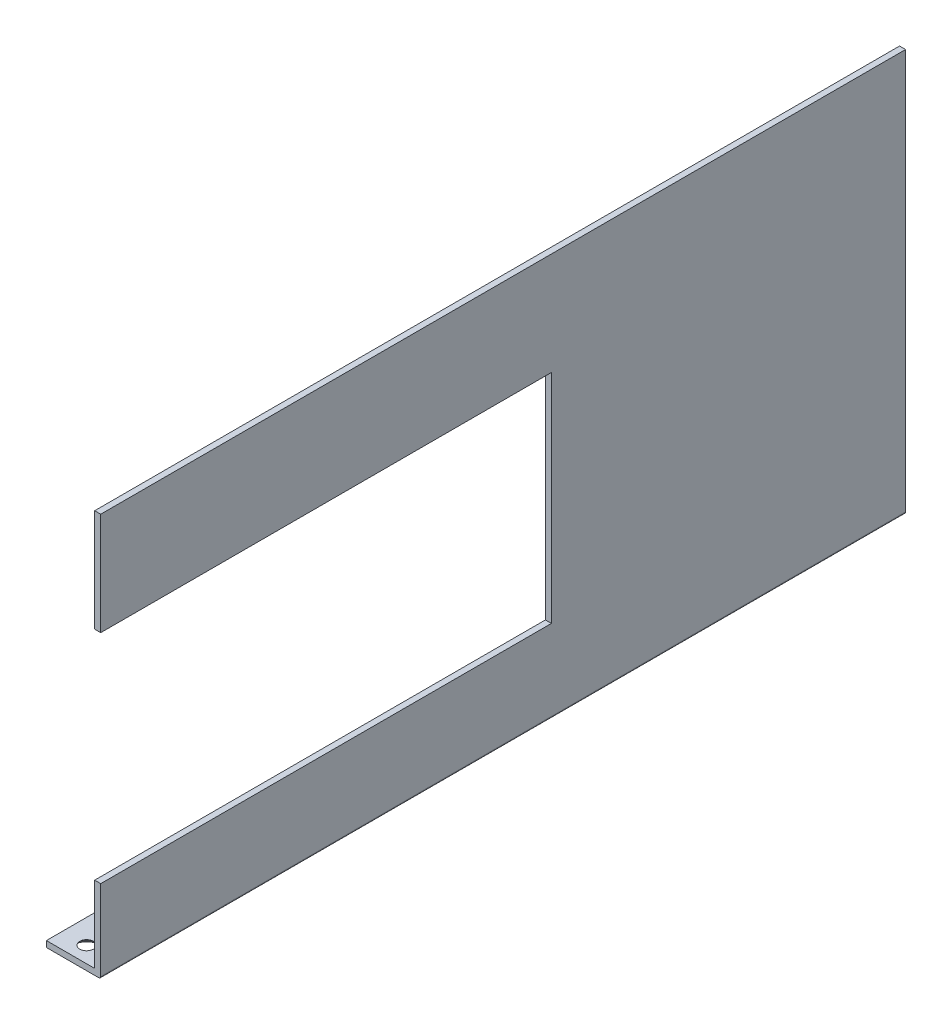
ISO-10303-21;
HEADER;
FILE_DESCRIPTION(('STEP AP214'),'2;1');
FILE_NAME('part.step','',(''),(''),'','','');
FILE_SCHEMA(('AUTOMOTIVE_DESIGN { 1 0 10303 214 1 1 1 1 }'));
ENDSEC;
DATA;
#1=APPLICATION_CONTEXT('core data for automotive mechanical design processes');
#2=APPLICATION_PROTOCOL_DEFINITION('international standard','automotive_design',2000,#1);
#3=PRODUCT_CONTEXT('',#1,'mechanical');
#4=PRODUCT('Part','Part','',(#3));
#5=PRODUCT_RELATED_PRODUCT_CATEGORY('part','',(#4));
#6=PRODUCT_DEFINITION_FORMATION('','',#4);
#7=PRODUCT_DEFINITION_CONTEXT('part definition',#1,'design');
#8=PRODUCT_DEFINITION('design','',#6,#7);
#9=PRODUCT_DEFINITION_SHAPE('','',#8);
#10=(LENGTH_UNIT() NAMED_UNIT(*) SI_UNIT(.MILLI.,.METRE.));
#11=(NAMED_UNIT(*) PLANE_ANGLE_UNIT() SI_UNIT($,.RADIAN.));
#12=(NAMED_UNIT(*) SI_UNIT($,.STERADIAN.) SOLID_ANGLE_UNIT());
#13=UNCERTAINTY_MEASURE_WITH_UNIT(LENGTH_MEASURE(1.E-05),#10,'distance_accuracy_value','');
#14=(GEOMETRIC_REPRESENTATION_CONTEXT(3) GLOBAL_UNCERTAINTY_ASSIGNED_CONTEXT((#13)) GLOBAL_UNIT_ASSIGNED_CONTEXT((#10,
#11,#12)) REPRESENTATION_CONTEXT('',''));
#15=CARTESIAN_POINT('',(0.,0.,0.));
#16=DIRECTION('',(0.,0.,1.));
#17=DIRECTION('',(1.,0.,0.));
#18=AXIS2_PLACEMENT_3D('',#15,#16,#17);
#19=CARTESIAN_POINT('',(12.,1.5,200.));
#20=DIRECTION('',(0.,-1.,0.));
#21=DIRECTION('',(1.,0.,0.));
#22=AXIS2_PLACEMENT_3D('',#19,#20,#21);
#23=PLANE('',#22);
#24=CARTESIAN_POINT('',(6.,1.5,196.));
#25=DIRECTION('',(0.,-1.,0.));
#26=DIRECTION('',(1.,0.,0.));
#27=AXIS2_PLACEMENT_3D('',#24,#25,#26);
#28=CIRCLE('',#27,1.69999999999999);
#29=CARTESIAN_POINT('',(7.69999999999999,1.5,196.));
#30=VERTEX_POINT('',#29);
#31=EDGE_CURVE('E226',#30,#30,#28,.F.);
#32=ORIENTED_EDGE('',*,*,#31,.F.);
#33=EDGE_LOOP('',(#32));
#34=FACE_BOUND('',#33,.T.);
#35=DIRECTION('',(-1.,0.,0.));
#36=VECTOR('',#35,1.);
#37=CARTESIAN_POINT('',(12.,1.5,0.));
#38=LINE('',#37,#36);
#39=CARTESIAN_POINT('',(12.,1.5,0.));
#40=VERTEX_POINT('',#39);
#41=CARTESIAN_POINT('',(0.,1.5,0.));
#42=VERTEX_POINT('',#41);
#43=EDGE_CURVE('E192',#40,#42,#38,.T.);
#44=ORIENTED_EDGE('',*,*,#43,.T.);
#45=DIRECTION('',(0.,0.,-1.));
#46=VECTOR('',#45,1.);
#47=CARTESIAN_POINT('',(0.,1.5,200.));
#48=LINE('',#47,#46);
#49=CARTESIAN_POINT('',(0.,1.5,200.));
#50=VERTEX_POINT('',#49);
#51=EDGE_CURVE('E149',#50,#42,#48,.T.);
#52=ORIENTED_EDGE('',*,*,#51,.F.);
#53=DIRECTION('',(-1.,0.,0.));
#54=VECTOR('',#53,1.);
#55=CARTESIAN_POINT('',(12.,1.5,200.));
#56=LINE('',#55,#54);
#57=CARTESIAN_POINT('',(12.,1.5,200.));
#58=VERTEX_POINT('',#57);
#59=EDGE_CURVE('E147',#58,#50,#56,.T.);
#60=ORIENTED_EDGE('',*,*,#59,.F.);
#61=DIRECTION('',(0.,0.,-1.));
#62=VECTOR('',#61,1.);
#63=CARTESIAN_POINT('',(12.,1.5,200.));
#64=LINE('',#63,#62);
#65=EDGE_CURVE('E152',#58,#40,#64,.T.);
#66=ORIENTED_EDGE('',*,*,#65,.T.);
#67=EDGE_LOOP('',(#44,#52,#60,#66));
#68=FACE_BOUND('',#67,.T.);
#69=CARTESIAN_POINT('',(6.,1.5,4.));
#70=DIRECTION('',(0.,-1.,0.));
#71=DIRECTION('',(1.,0.,0.));
#72=AXIS2_PLACEMENT_3D('',#69,#70,#71);
#73=CIRCLE('',#72,1.69999999999999);
#74=CARTESIAN_POINT('',(7.69999999999999,1.5,4.));
#75=VERTEX_POINT('',#74);
#76=EDGE_CURVE('E119',#75,#75,#73,.F.);
#77=ORIENTED_EDGE('',*,*,#76,.F.);
#78=EDGE_LOOP('',(#77));
#79=FACE_BOUND('',#78,.T.);
#80=ADVANCED_FACE('F31',(#34,#68,#79),#23,.F.);
#81=CARTESIAN_POINT('',(0.,100.,200.));
#82=DIRECTION('',(0.,0.,-1.));
#83=DIRECTION('',(-1.,0.,0.));
#84=AXIS2_PLACEMENT_3D('',#81,#82,#83);
#85=PLANE('',#84);
#86=DIRECTION('',(0.,-1.,0.));
#87=VECTOR('',#86,1.);
#88=CARTESIAN_POINT('',(12.,100.,200.));
#89=LINE('',#88,#87);
#90=CARTESIAN_POINT('',(12.,100.,200.));
#91=VERTEX_POINT('',#90);
#92=CARTESIAN_POINT('',(12.,74.5,200.));
#93=VERTEX_POINT('',#92);
#94=EDGE_CURVE('E144',#91,#93,#89,.T.);
#95=ORIENTED_EDGE('',*,*,#94,.T.);
#96=DIRECTION('',(-1.,0.,0.));
#97=VECTOR('',#96,1.);
#98=CARTESIAN_POINT('',(0.,74.5,200.));
#99=LINE('',#98,#97);
#100=CARTESIAN_POINT('',(13.5,74.5,200.));
#101=VERTEX_POINT('',#100);
#102=EDGE_CURVE('E118',#101,#93,#99,.T.);
#103=ORIENTED_EDGE('',*,*,#102,.F.);
#104=DIRECTION('',(0.,1.,0.));
#105=VECTOR('',#104,1.);
#106=CARTESIAN_POINT('',(13.5,0.,200.));
#107=LINE('',#106,#105);
#108=CARTESIAN_POINT('',(13.5,100.,200.));
#109=VERTEX_POINT('',#108);
#110=EDGE_CURVE('E136',#101,#109,#107,.T.);
#111=ORIENTED_EDGE('',*,*,#110,.T.);
#112=DIRECTION('',(-1.,0.,0.));
#113=VECTOR('',#112,1.);
#114=CARTESIAN_POINT('',(13.5,100.,200.));
#115=LINE('',#114,#113);
#116=EDGE_CURVE('E135',#109,#91,#115,.T.);
#117=ORIENTED_EDGE('',*,*,#116,.T.);
#118=EDGE_LOOP('',(#95,#103,#111,#117));
#119=FACE_BOUND('',#118,.T.);
#120=ADVANCED_FACE('F259',(#119),#85,.F.);
#121=CARTESIAN_POINT('',(0.,1.5,200.));
#122=DIRECTION('',(1.,0.,0.));
#123=DIRECTION('',(0.,1.,0.));
#124=AXIS2_PLACEMENT_3D('',#121,#122,#123);
#125=PLANE('',#124);
#126=DIRECTION('',(0.,-1.,0.));
#127=VECTOR('',#126,1.);
#128=CARTESIAN_POINT('',(0.,1.5,0.));
#129=LINE('',#128,#127);
#130=CARTESIAN_POINT('',(0.,0.,0.));
#131=VERTEX_POINT('',#130);
#132=EDGE_CURVE('E178',#42,#131,#129,.T.);
#133=ORIENTED_EDGE('',*,*,#132,.T.);
#134=DIRECTION('',(0.,0.,-1.));
#135=VECTOR('',#134,1.);
#136=CARTESIAN_POINT('',(0.,0.,200.));
#137=LINE('',#136,#135);
#138=CARTESIAN_POINT('',(0.,0.,200.));
#139=VERTEX_POINT('',#138);
#140=EDGE_CURVE('E161',#139,#131,#137,.T.);
#141=ORIENTED_EDGE('',*,*,#140,.F.);
#142=DIRECTION('',(0.,-1.,0.));
#143=VECTOR('',#142,1.);
#144=CARTESIAN_POINT('',(0.,1.5,200.));
#145=LINE('',#144,#143);
#146=EDGE_CURVE('E195',#50,#139,#145,.T.);
#147=ORIENTED_EDGE('',*,*,#146,.F.);
#148=ORIENTED_EDGE('',*,*,#51,.T.);
#149=EDGE_LOOP('',(#133,#141,#147,#148));
#150=FACE_BOUND('',#149,.T.);
#151=ADVANCED_FACE('F33',(#150),#125,.F.);
#152=CARTESIAN_POINT('',(0.,0.,200.));
#153=DIRECTION('',(0.,1.,0.));
#154=DIRECTION('',(0.,0.,1.));
#155=AXIS2_PLACEMENT_3D('',#152,#153,#154);
#156=PLANE('',#155);
#157=CARTESIAN_POINT('',(6.,0.,196.));
#158=DIRECTION('',(0.,-1.,0.));
#159=DIRECTION('',(0.,0.,-1.));
#160=AXIS2_PLACEMENT_3D('',#157,#158,#159);
#161=CIRCLE('',#160,3.15);
#162=CARTESIAN_POINT('',(6.,0.,192.85));
#163=VERTEX_POINT('',#162);
#164=EDGE_CURVE('E232',#163,#163,#161,.T.);
#165=ORIENTED_EDGE('',*,*,#164,.F.);
#166=EDGE_LOOP('',(#165));
#167=FACE_BOUND('',#166,.T.);
#168=CARTESIAN_POINT('',(6.,0.,4.));
#169=DIRECTION('',(0.,-1.,0.));
#170=DIRECTION('',(0.,0.,-1.));
#171=AXIS2_PLACEMENT_3D('',#168,#169,#170);
#172=CIRCLE('',#171,3.15);
#173=CARTESIAN_POINT('',(6.,0.,0.850000000000003));
#174=VERTEX_POINT('',#173);
#175=EDGE_CURVE('E223',#174,#174,#172,.T.);
#176=ORIENTED_EDGE('',*,*,#175,.F.);
#177=EDGE_LOOP('',(#176));
#178=FACE_BOUND('',#177,.T.);
#179=DIRECTION('',(1.,0.,0.));
#180=VECTOR('',#179,1.);
#181=CARTESIAN_POINT('',(0.,0.,0.));
#182=LINE('',#181,#180);
#183=CARTESIAN_POINT('',(13.,0.,0.));
#184=VERTEX_POINT('',#183);
#185=EDGE_CURVE('E171',#131,#184,#182,.T.);
#186=ORIENTED_EDGE('',*,*,#185,.T.);
#187=DIRECTION('',(0.,0.,-1.));
#188=VECTOR('',#187,1.);
#189=CARTESIAN_POINT('',(13.,0.,200.));
#190=LINE('',#189,#188);
#191=CARTESIAN_POINT('',(13.,0.,200.));
#192=VERTEX_POINT('',#191);
#193=EDGE_CURVE('E39',#184,#192,#190,.F.);
#194=ORIENTED_EDGE('',*,*,#193,.T.);
#195=DIRECTION('',(1.,0.,0.));
#196=VECTOR('',#195,1.);
#197=CARTESIAN_POINT('',(0.,0.,200.));
#198=LINE('',#197,#196);
#199=EDGE_CURVE('E140',#139,#192,#198,.T.);
#200=ORIENTED_EDGE('',*,*,#199,.F.);
#201=ORIENTED_EDGE('',*,*,#140,.T.);
#202=EDGE_LOOP('',(#186,#194,#200,#201));
#203=FACE_BOUND('',#202,.T.);
#204=ADVANCED_FACE('F175',(#167,#178,#203),#156,.F.);
#205=CARTESIAN_POINT('',(13.5,0.,200.));
#206=DIRECTION('',(-1.,0.,0.));
#207=DIRECTION('',(0.,0.,1.));
#208=AXIS2_PLACEMENT_3D('',#205,#206,#207);
#209=PLANE('',#208);
#210=ORIENTED_EDGE('',*,*,#110,.F.);
#211=DIRECTION('',(0.,0.,1.));
#212=VECTOR('',#211,1.);
#213=CARTESIAN_POINT('',(13.5,74.5,88.));
#214=LINE('',#213,#212);
#215=CARTESIAN_POINT('',(13.5,74.5,88.));
#216=VERTEX_POINT('',#215);
#217=EDGE_CURVE('E131',#216,#101,#214,.T.);
#218=ORIENTED_EDGE('',*,*,#217,.F.);
#219=DIRECTION('',(0.,1.,0.));
#220=VECTOR('',#219,1.);
#221=CARTESIAN_POINT('',(13.5,100.,88.));
#222=LINE('',#221,#220);
#223=CARTESIAN_POINT('',(13.5,20.5,88.));
#224=VERTEX_POINT('',#223);
#225=EDGE_CURVE('E130',#224,#216,#222,.T.);
#226=ORIENTED_EDGE('',*,*,#225,.F.);
#227=DIRECTION('',(0.,0.,1.));
#228=VECTOR('',#227,1.);
#229=CARTESIAN_POINT('',(13.5,20.5,88.));
#230=LINE('',#229,#228);
#231=CARTESIAN_POINT('',(13.5,20.5,200.));
#232=VERTEX_POINT('',#231);
#233=EDGE_CURVE('E113',#224,#232,#230,.T.);
#234=ORIENTED_EDGE('',*,*,#233,.T.);
#235=CARTESIAN_POINT('',(13.5,0.5,200.));
#236=VERTEX_POINT('',#235);
#237=EDGE_CURVE('E127',#236,#232,#107,.T.);
#238=ORIENTED_EDGE('',*,*,#237,.F.);
#239=DIRECTION('',(0.,0.,-1.));
#240=VECTOR('',#239,1.);
#241=CARTESIAN_POINT('',(13.5,0.5,200.));
#242=LINE('',#241,#240);
#243=CARTESIAN_POINT('',(13.5,0.5,0.));
#244=VERTEX_POINT('',#243);
#245=EDGE_CURVE('E164',#236,#244,#242,.T.);
#246=ORIENTED_EDGE('',*,*,#245,.T.);
#247=DIRECTION('',(0.,1.,0.));
#248=VECTOR('',#247,1.);
#249=CARTESIAN_POINT('',(13.5,0.,0.));
#250=LINE('',#249,#248);
#251=CARTESIAN_POINT('',(13.5,100.,0.));
#252=VERTEX_POINT('',#251);
#253=EDGE_CURVE('E173',#244,#252,#250,.T.);
#254=ORIENTED_EDGE('',*,*,#253,.T.);
#255=DIRECTION('',(0.,0.,-1.));
#256=VECTOR('',#255,1.);
#257=CARTESIAN_POINT('',(13.5,100.,200.));
#258=LINE('',#257,#256);
#259=EDGE_CURVE('E158',#109,#252,#258,.T.);
#260=ORIENTED_EDGE('',*,*,#259,.F.);
#261=EDGE_LOOP('',(#210,#218,#226,#234,#238,#246,#254,#260));
#262=FACE_BOUND('',#261,.T.);
#263=ADVANCED_FACE('F125',(#262),#209,.F.);
#264=CARTESIAN_POINT('',(13.5,100.,200.));
#265=DIRECTION('',(0.,-1.,0.));
#266=DIRECTION('',(0.,0.,-1.));
#267=AXIS2_PLACEMENT_3D('',#264,#265,#266);
#268=PLANE('',#267);
#269=DIRECTION('',(-1.,0.,0.));
#270=VECTOR('',#269,1.);
#271=CARTESIAN_POINT('',(13.5,100.,0.));
#272=LINE('',#271,#270);
#273=CARTESIAN_POINT('',(12.,100.,0.));
#274=VERTEX_POINT('',#273);
#275=EDGE_CURVE('E183',#252,#274,#272,.T.);
#276=ORIENTED_EDGE('',*,*,#275,.T.);
#277=DIRECTION('',(0.,0.,-1.));
#278=VECTOR('',#277,1.);
#279=CARTESIAN_POINT('',(12.,100.,200.));
#280=LINE('',#279,#278);
#281=EDGE_CURVE('E155',#91,#274,#280,.T.);
#282=ORIENTED_EDGE('',*,*,#281,.F.);
#283=ORIENTED_EDGE('',*,*,#116,.F.);
#284=ORIENTED_EDGE('',*,*,#259,.T.);
#285=EDGE_LOOP('',(#276,#282,#283,#284));
#286=FACE_BOUND('',#285,.T.);
#287=ADVANCED_FACE('F186',(#286),#268,.F.);
#288=CARTESIAN_POINT('',(12.,100.,200.));
#289=DIRECTION('',(1.,0.,0.));
#290=DIRECTION('',(0.,1.,0.));
#291=AXIS2_PLACEMENT_3D('',#288,#289,#290);
#292=PLANE('',#291);
#293=DIRECTION('',(0.,-1.,0.));
#294=VECTOR('',#293,1.);
#295=CARTESIAN_POINT('',(12.,100.,88.));
#296=LINE('',#295,#294);
#297=CARTESIAN_POINT('',(12.,74.5,88.));
#298=VERTEX_POINT('',#297);
#299=CARTESIAN_POINT('',(12.,20.5,88.));
#300=VERTEX_POINT('',#299);
#301=EDGE_CURVE('E214',#298,#300,#296,.T.);
#302=ORIENTED_EDGE('',*,*,#301,.F.);
#303=DIRECTION('',(0.,0.,1.));
#304=VECTOR('',#303,1.);
#305=CARTESIAN_POINT('',(12.,74.5,88.));
#306=LINE('',#305,#304);
#307=EDGE_CURVE('E201',#298,#93,#306,.T.);
#308=ORIENTED_EDGE('',*,*,#307,.T.);
#309=ORIENTED_EDGE('',*,*,#94,.F.);
#310=ORIENTED_EDGE('',*,*,#281,.T.);
#311=DIRECTION('',(0.,-1.,0.));
#312=VECTOR('',#311,1.);
#313=CARTESIAN_POINT('',(12.,100.,0.));
#314=LINE('',#313,#312);
#315=EDGE_CURVE('E190',#274,#40,#314,.T.);
#316=ORIENTED_EDGE('',*,*,#315,.T.);
#317=ORIENTED_EDGE('',*,*,#65,.F.);
#318=CARTESIAN_POINT('',(12.,20.5,200.));
#319=VERTEX_POINT('',#318);
#320=EDGE_CURVE('E138',#319,#58,#89,.T.);
#321=ORIENTED_EDGE('',*,*,#320,.F.);
#322=DIRECTION('',(0.,0.,1.));
#323=VECTOR('',#322,1.);
#324=CARTESIAN_POINT('',(12.,20.5,88.));
#325=LINE('',#324,#323);
#326=EDGE_CURVE('E46',#300,#319,#325,.T.);
#327=ORIENTED_EDGE('',*,*,#326,.F.);
#328=EDGE_LOOP('',(#302,#308,#309,#310,#316,#317,#321,#327));
#329=FACE_BOUND('',#328,.T.);
#330=ADVANCED_FACE('F271',(#329),#292,.F.);
#331=ORIENTED_EDGE('',*,*,#237,.T.);
#332=DIRECTION('',(1.,0.,0.));
#333=VECTOR('',#332,1.);
#334=CARTESIAN_POINT('',(0.,20.5,200.));
#335=LINE('',#334,#333);
#336=EDGE_CURVE('E110',#319,#232,#335,.T.);
#337=ORIENTED_EDGE('',*,*,#336,.F.);
#338=ORIENTED_EDGE('',*,*,#320,.T.);
#339=ORIENTED_EDGE('',*,*,#59,.T.);
#340=ORIENTED_EDGE('',*,*,#146,.T.);
#341=ORIENTED_EDGE('',*,*,#199,.T.);
#342=CARTESIAN_POINT('',(13.,0.5,200.));
#343=DIRECTION('',(0.,0.,-1.));
#344=DIRECTION('',(-1.,0.,0.));
#345=AXIS2_PLACEMENT_3D('',#342,#343,#344);
#346=CIRCLE('',#345,0.5);
#347=EDGE_CURVE('E11',#192,#236,#346,.F.);
#348=ORIENTED_EDGE('',*,*,#347,.T.);
#349=EDGE_LOOP('',(#331,#337,#338,#339,#340,#341,#348));
#350=FACE_BOUND('',#349,.T.);
#351=ADVANCED_FACE('F133',(#350),#85,.F.);
#352=CARTESIAN_POINT('',(0.,100.,0.));
#353=DIRECTION('',(0.,0.,-1.));
#354=DIRECTION('',(-1.,0.,0.));
#355=AXIS2_PLACEMENT_3D('',#352,#353,#354);
#356=PLANE('',#355);
#357=ORIENTED_EDGE('',*,*,#253,.F.);
#358=CARTESIAN_POINT('',(13.,0.5,0.));
#359=DIRECTION('',(0.,0.,-1.));
#360=DIRECTION('',(-1.,0.,0.));
#361=AXIS2_PLACEMENT_3D('',#358,#359,#360);
#362=CIRCLE('',#361,0.5);
#363=EDGE_CURVE('E166',#244,#184,#362,.T.);
#364=ORIENTED_EDGE('',*,*,#363,.T.);
#365=ORIENTED_EDGE('',*,*,#185,.F.);
#366=ORIENTED_EDGE('',*,*,#132,.F.);
#367=ORIENTED_EDGE('',*,*,#43,.F.);
#368=ORIENTED_EDGE('',*,*,#315,.F.);
#369=ORIENTED_EDGE('',*,*,#275,.F.);
#370=EDGE_LOOP('',(#357,#364,#365,#366,#367,#368,#369));
#371=FACE_BOUND('',#370,.T.);
#372=ADVANCED_FACE('F169',(#371),#356,.T.);
#373=CARTESIAN_POINT('',(13.,0.5,200.));
#374=DIRECTION('',(0.,0.,-1.));
#375=DIRECTION('',(-1.,0.,0.));
#376=AXIS2_PLACEMENT_3D('',#373,#374,#375);
#377=CYLINDRICAL_SURFACE('',#376,0.5);
#378=ORIENTED_EDGE('',*,*,#347,.F.);
#379=ORIENTED_EDGE('',*,*,#193,.F.);
#380=ORIENTED_EDGE('',*,*,#363,.F.);
#381=ORIENTED_EDGE('',*,*,#245,.F.);
#382=EDGE_LOOP('',(#378,#379,#380,#381));
#383=FACE_BOUND('',#382,.T.);
#384=ADVANCED_FACE('F180',(#383),#377,.T.);
#385=CARTESIAN_POINT('',(0.,74.5,88.));
#386=DIRECTION('',(0.,1.,0.));
#387=DIRECTION('',(0.,0.,1.));
#388=AXIS2_PLACEMENT_3D('',#385,#386,#387);
#389=PLANE('',#388);
#390=ORIENTED_EDGE('',*,*,#102,.T.);
#391=ORIENTED_EDGE('',*,*,#307,.F.);
#392=DIRECTION('',(-1.,0.,0.));
#393=VECTOR('',#392,1.);
#394=CARTESIAN_POINT('',(0.,74.5,88.));
#395=LINE('',#394,#393);
#396=EDGE_CURVE('E206',#216,#298,#395,.T.);
#397=ORIENTED_EDGE('',*,*,#396,.F.);
#398=ORIENTED_EDGE('',*,*,#217,.T.);
#399=EDGE_LOOP('',(#390,#391,#397,#398));
#400=FACE_BOUND('',#399,.T.);
#401=ADVANCED_FACE('F310',(#400),#389,.F.);
#402=CARTESIAN_POINT('',(0.,20.5,88.));
#403=DIRECTION('',(0.,-1.,0.));
#404=DIRECTION('',(0.,0.,-1.));
#405=AXIS2_PLACEMENT_3D('',#402,#403,#404);
#406=PLANE('',#405);
#407=ORIENTED_EDGE('',*,*,#336,.T.);
#408=ORIENTED_EDGE('',*,*,#233,.F.);
#409=DIRECTION('',(1.,0.,0.));
#410=VECTOR('',#409,1.);
#411=CARTESIAN_POINT('',(0.,20.5,88.));
#412=LINE('',#411,#410);
#413=EDGE_CURVE('E212',#300,#224,#412,.T.);
#414=ORIENTED_EDGE('',*,*,#413,.F.);
#415=ORIENTED_EDGE('',*,*,#326,.T.);
#416=EDGE_LOOP('',(#407,#408,#414,#415));
#417=FACE_BOUND('',#416,.T.);
#418=ADVANCED_FACE('F112',(#417),#406,.F.);
#419=CARTESIAN_POINT('',(12.,20.5,88.));
#420=DIRECTION('',(0.,0.,1.));
#421=DIRECTION('',(1.,0.,0.));
#422=AXIS2_PLACEMENT_3D('',#419,#420,#421);
#423=PLANE('',#422);
#424=ORIENTED_EDGE('',*,*,#301,.T.);
#425=ORIENTED_EDGE('',*,*,#413,.T.);
#426=ORIENTED_EDGE('',*,*,#225,.T.);
#427=ORIENTED_EDGE('',*,*,#396,.T.);
#428=EDGE_LOOP('',(#424,#425,#426,#427));
#429=FACE_BOUND('',#428,.T.);
#430=ADVANCED_FACE('F254',(#429),#423,.T.);
#431=CARTESIAN_POINT('',(6.,0.,4.));
#432=DIRECTION('',(0.,-1.,0.));
#433=DIRECTION('',(0.,0.,-1.));
#434=AXIS2_PLACEMENT_3D('',#431,#432,#433);
#435=CYLINDRICAL_SURFACE('',#434,1.69999999999999);
#436=ORIENTED_EDGE('',*,*,#76,.T.);
#437=EDGE_LOOP('',(#436));
#438=FACE_BOUND('',#437,.T.);
#439=CARTESIAN_POINT('',(6.,1.45000000000001,4.));
#440=DIRECTION('',(0.,-1.,0.));
#441=DIRECTION('',(0.,0.,-1.));
#442=AXIS2_PLACEMENT_3D('',#439,#440,#441);
#443=CIRCLE('',#442,1.69999999999999);
#444=CARTESIAN_POINT('',(6.,1.45000000000001,2.30000000000002));
#445=VERTEX_POINT('',#444);
#446=EDGE_CURVE('E220',#445,#445,#443,.T.);
#447=ORIENTED_EDGE('',*,*,#446,.T.);
#448=EDGE_LOOP('',(#447));
#449=FACE_BOUND('',#448,.T.);
#450=ADVANCED_FACE('F245',(#438,#449),#435,.F.);
#451=CARTESIAN_POINT('',(6.,0.,4.));
#452=DIRECTION('',(0.,-1.,0.));
#453=DIRECTION('',(0.,0.,-1.));
#454=AXIS2_PLACEMENT_3D('',#451,#452,#453);
#455=CONICAL_SURFACE('',#454,3.15,0.78539816339745);
#456=ORIENTED_EDGE('',*,*,#446,.F.);
#457=EDGE_LOOP('',(#456));
#458=FACE_BOUND('',#457,.T.);
#459=ORIENTED_EDGE('',*,*,#175,.T.);
#460=EDGE_LOOP('',(#459));
#461=FACE_BOUND('',#460,.T.);
#462=ADVANCED_FACE('F242',(#458,#461),#455,.F.);
#463=CARTESIAN_POINT('',(6.,0.,196.));
#464=DIRECTION('',(0.,-1.,0.));
#465=DIRECTION('',(0.,0.,-1.));
#466=AXIS2_PLACEMENT_3D('',#463,#464,#465);
#467=CYLINDRICAL_SURFACE('',#466,1.69999999999999);
#468=ORIENTED_EDGE('',*,*,#31,.T.);
#469=EDGE_LOOP('',(#468));
#470=FACE_BOUND('',#469,.T.);
#471=CARTESIAN_POINT('',(6.,1.45000000000001,196.));
#472=DIRECTION('',(0.,-1.,0.));
#473=DIRECTION('',(0.,0.,-1.));
#474=AXIS2_PLACEMENT_3D('',#471,#472,#473);
#475=CIRCLE('',#474,1.69999999999999);
#476=CARTESIAN_POINT('',(6.,1.45000000000001,194.3));
#477=VERTEX_POINT('',#476);
#478=EDGE_CURVE('E229',#477,#477,#475,.T.);
#479=ORIENTED_EDGE('',*,*,#478,.T.);
#480=EDGE_LOOP('',(#479));
#481=FACE_BOUND('',#480,.T.);
#482=ADVANCED_FACE('F244',(#470,#481),#467,.F.);
#483=CARTESIAN_POINT('',(6.,0.,196.));
#484=DIRECTION('',(0.,-1.,0.));
#485=DIRECTION('',(0.,0.,-1.));
#486=AXIS2_PLACEMENT_3D('',#483,#484,#485);
#487=CONICAL_SURFACE('',#486,3.15,0.785398163397449);
#488=ORIENTED_EDGE('',*,*,#478,.F.);
#489=EDGE_LOOP('',(#488));
#490=FACE_BOUND('',#489,.T.);
#491=ORIENTED_EDGE('',*,*,#164,.T.);
#492=EDGE_LOOP('',(#491));
#493=FACE_BOUND('',#492,.T.);
#494=ADVANCED_FACE('F236',(#490,#493),#487,.F.);
#495=CLOSED_SHELL('',(#80,#120,#151,#204,#263,#287,#330,#351,#372,#384,#401,#418,#430,#450,#462,
#482,#494));
#496=MANIFOLD_SOLID_BREP('B2',#495);
#497=ADVANCED_BREP_SHAPE_REPRESENTATION('',(#18,#496),#14);
#498=SHAPE_DEFINITION_REPRESENTATION(#9,#497);
ENDSEC;
END-ISO-10303-21;
